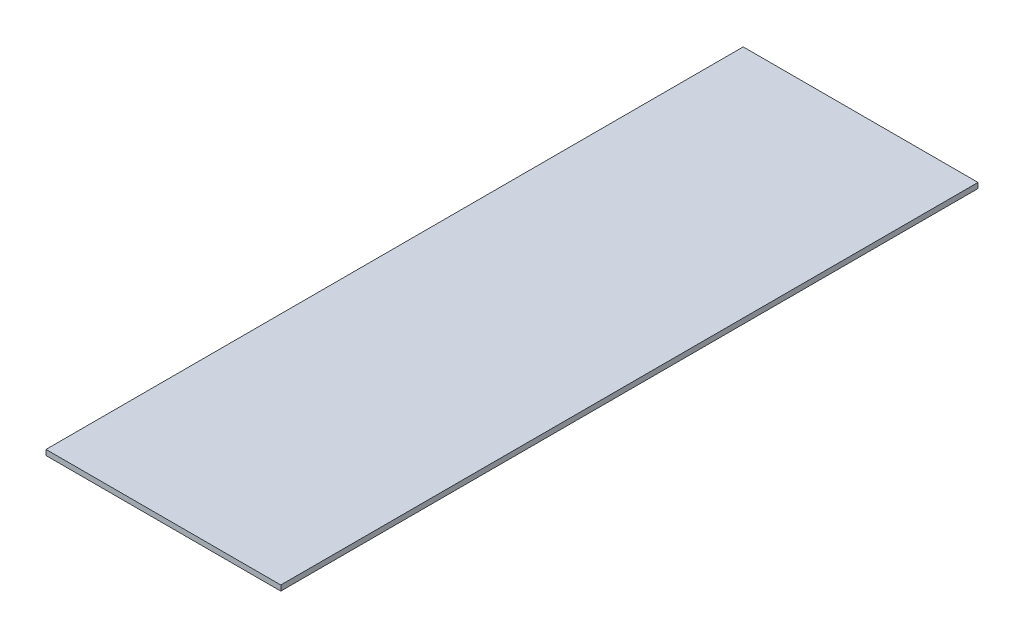
ISO-10303-21;
HEADER;
FILE_DESCRIPTION(('STEP AP214'),'2;1');
FILE_NAME('part.step','',(''),(''),'','','');
FILE_SCHEMA(('AUTOMOTIVE_DESIGN { 1 0 10303 214 1 1 1 1 }'));
ENDSEC;
DATA;
#1=APPLICATION_CONTEXT('core data for automotive mechanical design processes');
#2=APPLICATION_PROTOCOL_DEFINITION('international standard','automotive_design',2000,#1);
#3=PRODUCT_CONTEXT('',#1,'mechanical');
#4=PRODUCT('Part','Part','',(#3));
#5=PRODUCT_RELATED_PRODUCT_CATEGORY('part','',(#4));
#6=PRODUCT_DEFINITION_FORMATION('','',#4);
#7=PRODUCT_DEFINITION_CONTEXT('part definition',#1,'design');
#8=PRODUCT_DEFINITION('design','',#6,#7);
#9=PRODUCT_DEFINITION_SHAPE('','',#8);
#10=(LENGTH_UNIT() NAMED_UNIT(*) SI_UNIT(.MILLI.,.METRE.));
#11=(NAMED_UNIT(*) PLANE_ANGLE_UNIT() SI_UNIT($,.RADIAN.));
#12=(NAMED_UNIT(*) SI_UNIT($,.STERADIAN.) SOLID_ANGLE_UNIT());
#13=UNCERTAINTY_MEASURE_WITH_UNIT(LENGTH_MEASURE(1.E-05),#10,'distance_accuracy_value','');
#14=(GEOMETRIC_REPRESENTATION_CONTEXT(3) GLOBAL_UNCERTAINTY_ASSIGNED_CONTEXT((#13)) GLOBAL_UNIT_ASSIGNED_CONTEXT((#10,
#11,#12)) REPRESENTATION_CONTEXT('',''));
#15=CARTESIAN_POINT('',(0.,0.,0.));
#16=DIRECTION('',(0.,0.,1.));
#17=DIRECTION('',(1.,0.,0.));
#18=AXIS2_PLACEMENT_3D('',#15,#16,#17);
#19=CARTESIAN_POINT('',(2.66453525910038E-12,-2.66453525910038E-12,4978.4));
#20=DIRECTION('',(1.,0.,0.));
#21=DIRECTION('',(0.,1.,0.));
#22=AXIS2_PLACEMENT_3D('',#19,#20,#21);
#23=PLANE('',#22);
#24=DIRECTION('',(0.,-1.,0.));
#25=VECTOR('',#24,1.);
#26=CARTESIAN_POINT('',(0.,0.,0.));
#27=LINE('',#26,#25);
#28=CARTESIAN_POINT('',(-4.44089209850063E-13,38.1,0.));
#29=VERTEX_POINT('',#28);
#30=CARTESIAN_POINT('',(0.,0.,0.));
#31=VERTEX_POINT('',#30);
#32=EDGE_CURVE('E95',#29,#31,#27,.T.);
#33=ORIENTED_EDGE('',*,*,#32,.T.);
#34=DIRECTION('',(0.,0.,-1.));
#35=VECTOR('',#34,1.);
#36=CARTESIAN_POINT('',(2.66453525910038E-12,-2.66453525910038E-12,4978.4));
#37=LINE('',#36,#35);
#38=CARTESIAN_POINT('',(2.66453525910038E-12,-2.66453525910038E-12,4978.4));
#39=VERTEX_POINT('',#38);
#40=EDGE_CURVE('E11',#39,#31,#37,.T.);
#41=ORIENTED_EDGE('',*,*,#40,.F.);
#42=DIRECTION('',(0.,-1.,0.));
#43=VECTOR('',#42,1.);
#44=CARTESIAN_POINT('',(2.66453525910038E-12,-2.66453525910038E-12,4978.4));
#45=LINE('',#44,#43);
#46=CARTESIAN_POINT('',(2.66453525910038E-12,38.0999999999974,4978.4));
#47=VERTEX_POINT('',#46);
#48=EDGE_CURVE('E83',#47,#39,#45,.T.);
#49=ORIENTED_EDGE('',*,*,#48,.F.);
#50=DIRECTION('',(0.,0.,-1.));
#51=VECTOR('',#50,1.);
#52=CARTESIAN_POINT('',(2.66453525910038E-12,38.0999999999974,4978.4));
#53=LINE('',#52,#51);
#54=EDGE_CURVE('E91',#47,#29,#53,.T.);
#55=ORIENTED_EDGE('',*,*,#54,.T.);
#56=EDGE_LOOP('',(#33,#41,#49,#55));
#57=FACE_BOUND('',#56,.T.);
#58=ADVANCED_FACE('F32',(#57),#23,.F.);
#59=CARTESIAN_POINT('',(2.66453525910038E-12,-2.66453525910038E-12,4978.4));
#60=DIRECTION('',(0.,1.,0.));
#61=DIRECTION('',(0.,0.,1.));
#62=AXIS2_PLACEMENT_3D('',#59,#60,#61);
#63=PLANE('',#62);
#64=DIRECTION('',(1.,0.,0.));
#65=VECTOR('',#64,1.);
#66=CARTESIAN_POINT('',(0.,0.,0.));
#67=LINE('',#66,#65);
#68=CARTESIAN_POINT('',(1676.40000000001,0.,0.));
#69=VERTEX_POINT('',#68);
#70=EDGE_CURVE('E87',#31,#69,#67,.T.);
#71=ORIENTED_EDGE('',*,*,#70,.T.);
#72=DIRECTION('',(0.,0.,-1.));
#73=VECTOR('',#72,1.);
#74=CARTESIAN_POINT('',(1676.40000000001,-2.66453525910038E-12,4978.4));
#75=LINE('',#74,#73);
#76=CARTESIAN_POINT('',(1676.40000000001,-2.66453525910038E-12,4978.4));
#77=VERTEX_POINT('',#76);
#78=EDGE_CURVE('E40',#77,#69,#75,.T.);
#79=ORIENTED_EDGE('',*,*,#78,.F.);
#80=DIRECTION('',(1.,0.,0.));
#81=VECTOR('',#80,1.);
#82=CARTESIAN_POINT('',(2.66453525910038E-12,-2.66453525910038E-12,4978.4));
#83=LINE('',#82,#81);
#84=EDGE_CURVE('E78',#39,#77,#83,.T.);
#85=ORIENTED_EDGE('',*,*,#84,.F.);
#86=ORIENTED_EDGE('',*,*,#40,.T.);
#87=EDGE_LOOP('',(#71,#79,#85,#86));
#88=FACE_BOUND('',#87,.T.);
#89=ADVANCED_FACE('F86',(#88),#63,.F.);
#90=CARTESIAN_POINT('',(1676.40000000001,-2.66453525910038E-12,4978.4));
#91=DIRECTION('',(-1.,0.,0.));
#92=DIRECTION('',(0.,-1.,0.));
#93=AXIS2_PLACEMENT_3D('',#90,#91,#92);
#94=PLANE('',#93);
#95=DIRECTION('',(0.,1.,0.));
#96=VECTOR('',#95,1.);
#97=CARTESIAN_POINT('',(1676.40000000001,0.,0.));
#98=LINE('',#97,#96);
#99=CARTESIAN_POINT('',(1676.40000000001,38.1,0.));
#100=VERTEX_POINT('',#99);
#101=EDGE_CURVE('E65',#69,#100,#98,.T.);
#102=ORIENTED_EDGE('',*,*,#101,.T.);
#103=DIRECTION('',(0.,0.,-1.));
#104=VECTOR('',#103,1.);
#105=CARTESIAN_POINT('',(1676.40000000001,38.0999999999974,4978.4));
#106=LINE('',#105,#104);
#107=CARTESIAN_POINT('',(1676.40000000001,38.0999999999974,4978.4));
#108=VERTEX_POINT('',#107);
#109=EDGE_CURVE('E88',#108,#100,#106,.T.);
#110=ORIENTED_EDGE('',*,*,#109,.F.);
#111=DIRECTION('',(0.,1.,0.));
#112=VECTOR('',#111,1.);
#113=CARTESIAN_POINT('',(1676.40000000001,-2.66453525910038E-12,4978.4));
#114=LINE('',#113,#112);
#115=EDGE_CURVE('E81',#77,#108,#114,.T.);
#116=ORIENTED_EDGE('',*,*,#115,.F.);
#117=ORIENTED_EDGE('',*,*,#78,.T.);
#118=EDGE_LOOP('',(#102,#110,#116,#117));
#119=FACE_BOUND('',#118,.T.);
#120=ADVANCED_FACE('F89',(#119),#94,.F.);
#121=CARTESIAN_POINT('',(2.66453525910038E-12,38.0999999999974,4978.4));
#122=DIRECTION('',(0.,-1.,0.));
#123=DIRECTION('',(0.,0.,-1.));
#124=AXIS2_PLACEMENT_3D('',#121,#122,#123);
#125=PLANE('',#124);
#126=DIRECTION('',(-1.,0.,0.));
#127=VECTOR('',#126,1.);
#128=CARTESIAN_POINT('',(-4.44089209850063E-13,38.1,0.));
#129=LINE('',#128,#127);
#130=EDGE_CURVE('E71',#100,#29,#129,.T.);
#131=ORIENTED_EDGE('',*,*,#130,.T.);
#132=ORIENTED_EDGE('',*,*,#54,.F.);
#133=DIRECTION('',(-1.,0.,0.));
#134=VECTOR('',#133,1.);
#135=CARTESIAN_POINT('',(2.66453525910038E-12,38.0999999999974,4978.4));
#136=LINE('',#135,#134);
#137=EDGE_CURVE('E48',#108,#47,#136,.T.);
#138=ORIENTED_EDGE('',*,*,#137,.F.);
#139=ORIENTED_EDGE('',*,*,#109,.T.);
#140=EDGE_LOOP('',(#131,#132,#138,#139));
#141=FACE_BOUND('',#140,.T.);
#142=ADVANCED_FACE('F102',(#141),#125,.F.);
#143=CARTESIAN_POINT('',(2.66453525910038E-12,-2.66453525910038E-12,4978.4));
#144=DIRECTION('',(0.,0.,-1.));
#145=DIRECTION('',(-1.,0.,0.));
#146=AXIS2_PLACEMENT_3D('',#143,#144,#145);
#147=PLANE('',#146);
#148=ORIENTED_EDGE('',*,*,#48,.T.);
#149=ORIENTED_EDGE('',*,*,#84,.T.);
#150=ORIENTED_EDGE('',*,*,#115,.T.);
#151=ORIENTED_EDGE('',*,*,#137,.T.);
#152=EDGE_LOOP('',(#148,#149,#150,#151));
#153=FACE_BOUND('',#152,.T.);
#154=ADVANCED_FACE('F79',(#153),#147,.F.);
#155=CARTESIAN_POINT('',(0.,0.,0.));
#156=DIRECTION('',(0.,0.,-1.));
#157=DIRECTION('',(-1.,0.,0.));
#158=AXIS2_PLACEMENT_3D('',#155,#156,#157);
#159=PLANE('',#158);
#160=ORIENTED_EDGE('',*,*,#32,.F.);
#161=ORIENTED_EDGE('',*,*,#130,.F.);
#162=ORIENTED_EDGE('',*,*,#101,.F.);
#163=ORIENTED_EDGE('',*,*,#70,.F.);
#164=EDGE_LOOP('',(#160,#161,#162,#163));
#165=FACE_BOUND('',#164,.T.);
#166=ADVANCED_FACE('F105',(#165),#159,.T.);
#167=CLOSED_SHELL('',(#58,#89,#120,#142,#154,#166));
#168=MANIFOLD_SOLID_BREP('B2',#167);
#169=ADVANCED_BREP_SHAPE_REPRESENTATION('',(#18,#168),#14);
#170=SHAPE_DEFINITION_REPRESENTATION(#9,#169);
ENDSEC;
END-ISO-10303-21;
